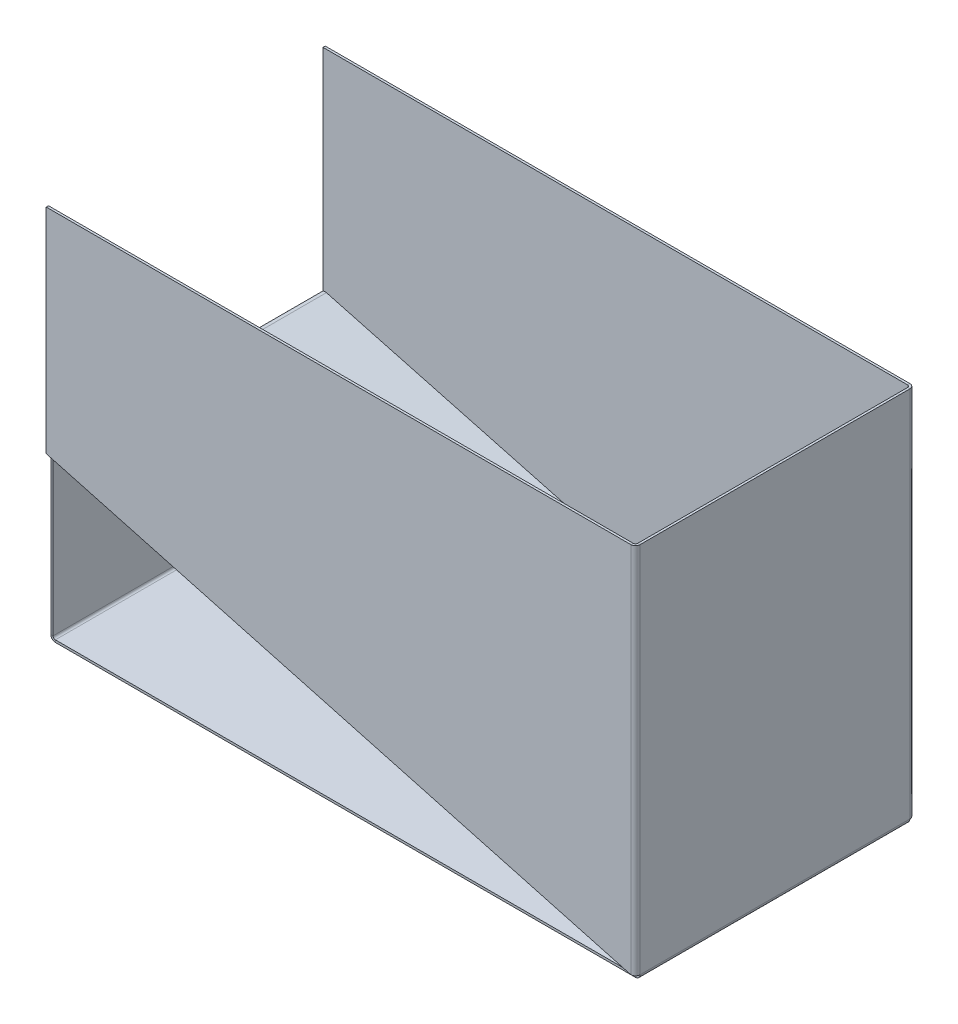
ISO-10303-21;
HEADER;
FILE_DESCRIPTION(('STEP AP214'),'2;1');
FILE_NAME('part.step','',(''),(''),'','','');
FILE_SCHEMA(('AUTOMOTIVE_DESIGN { 1 0 10303 214 1 1 1 1 }'));
ENDSEC;
DATA;
#1=APPLICATION_CONTEXT('core data for automotive mechanical design processes');
#2=APPLICATION_PROTOCOL_DEFINITION('international standard','automotive_design',2000,#1);
#3=PRODUCT_CONTEXT('',#1,'mechanical');
#4=PRODUCT('Part','Part','',(#3));
#5=PRODUCT_RELATED_PRODUCT_CATEGORY('part','',(#4));
#6=PRODUCT_DEFINITION_FORMATION('','',#4);
#7=PRODUCT_DEFINITION_CONTEXT('part definition',#1,'design');
#8=PRODUCT_DEFINITION('design','',#6,#7);
#9=PRODUCT_DEFINITION_SHAPE('','',#8);
#10=(LENGTH_UNIT() NAMED_UNIT(*) SI_UNIT(.MILLI.,.METRE.));
#11=(NAMED_UNIT(*) PLANE_ANGLE_UNIT() SI_UNIT($,.RADIAN.));
#12=(NAMED_UNIT(*) SI_UNIT($,.STERADIAN.) SOLID_ANGLE_UNIT());
#13=UNCERTAINTY_MEASURE_WITH_UNIT(LENGTH_MEASURE(1.E-05),#10,'distance_accuracy_value','');
#14=(GEOMETRIC_REPRESENTATION_CONTEXT(3) GLOBAL_UNCERTAINTY_ASSIGNED_CONTEXT((#13)) GLOBAL_UNIT_ASSIGNED_CONTEXT((#10,
#11,#12)) REPRESENTATION_CONTEXT('',''));
#15=CARTESIAN_POINT('',(0.,0.,0.));
#16=DIRECTION('',(0.,0.,1.));
#17=DIRECTION('',(1.,0.,0.));
#18=AXIS2_PLACEMENT_3D('',#15,#16,#17);
#19=CARTESIAN_POINT('',(0.,0.,1.522));
#20=DIRECTION('',(0.,0.,-1.));
#21=DIRECTION('',(-1.,0.,0.));
#22=AXIS2_PLACEMENT_3D('',#19,#20,#21);
#23=PLANE('',#22);
#24=DIRECTION('',(-0.964991177337424,0.262282343402928,0.));
#25=VECTOR('',#24,1.);
#26=CARTESIAN_POINT('',(-195.76,53.7620000000006,1.52200000000068));
#27=LINE('',#26,#25);
#28=CARTESIAN_POINT('',(-0.761999999999991,0.761999999999999,1.522));
#29=VERTEX_POINT('',#28);
#30=CARTESIAN_POINT('',(-195.76,53.7620000000007,1.52200000000068));
#31=VERTEX_POINT('',#30);
#32=EDGE_CURVE('E105',#29,#31,#27,.T.);
#33=ORIENTED_EDGE('',*,*,#32,.F.);
#34=DIRECTION('',(0.,1.,0.));
#35=VECTOR('',#34,1.);
#36=CARTESIAN_POINT('',(-0.761999999999995,0.762000000000339,1.522));
#37=LINE('',#36,#35);
#38=CARTESIAN_POINT('',(-0.761999999999561,125.,1.522));
#39=VERTEX_POINT('',#38);
#40=EDGE_CURVE('E266',#39,#29,#37,.F.);
#41=ORIENTED_EDGE('',*,*,#40,.F.);
#42=DIRECTION('',(-1.,0.,0.));
#43=VECTOR('',#42,1.);
#44=CARTESIAN_POINT('',(4.28004602885801E-13,125.,1.522));
#45=LINE('',#44,#43);
#46=CARTESIAN_POINT('',(-195.76,125.000000000001,1.52200000000068));
#47=VERTEX_POINT('',#46);
#48=EDGE_CURVE('E479',#39,#47,#45,.T.);
#49=ORIENTED_EDGE('',*,*,#48,.T.);
#50=DIRECTION('',(0.,-1.,0.));
#51=VECTOR('',#50,1.);
#52=CARTESIAN_POINT('',(-195.76,6.99744874517044E-13,1.52200000000068));
#53=LINE('',#52,#51);
#54=EDGE_CURVE('E269',#47,#31,#53,.T.);
#55=ORIENTED_EDGE('',*,*,#54,.T.);
#56=EDGE_LOOP('',(#33,#41,#49,#55));
#57=FACE_BOUND('',#56,.T.);
#58=ADVANCED_FACE('F88',(#57),#23,.F.);
#59=CARTESIAN_POINT('',(0.,0.,0.761999999999997));
#60=DIRECTION('',(0.,0.,-1.));
#61=DIRECTION('',(-1.,0.,0.));
#62=AXIS2_PLACEMENT_3D('',#59,#60,#61);
#63=PLANE('',#62);
#64=DIRECTION('',(0.,1.,0.));
#65=VECTOR('',#64,1.);
#66=CARTESIAN_POINT('',(-0.761999999999995,0.762000000000339,0.762));
#67=LINE('',#66,#65);
#68=CARTESIAN_POINT('',(-0.761999999999993,0.761999999999999,0.762000000000332));
#69=VERTEX_POINT('',#68);
#70=CARTESIAN_POINT('',(-0.761999999999554,125.,0.761999999999991));
#71=VERTEX_POINT('',#70);
#72=EDGE_CURVE('E259',#69,#71,#67,.T.);
#73=ORIENTED_EDGE('',*,*,#72,.F.);
#74=DIRECTION('',(-0.964991177337424,0.262282343402928,0.));
#75=VECTOR('',#74,1.);
#76=CARTESIAN_POINT('',(-195.76,53.7620000000006,0.762000000000679));
#77=LINE('',#76,#75);
#78=CARTESIAN_POINT('',(-195.76,53.7620000000007,0.762000000000681));
#79=VERTEX_POINT('',#78);
#80=EDGE_CURVE('E254',#69,#79,#77,.T.);
#81=ORIENTED_EDGE('',*,*,#80,.T.);
#82=DIRECTION('',(0.,1.,0.));
#83=VECTOR('',#82,1.);
#84=CARTESIAN_POINT('',(-195.76,0.762000000000681,0.762000000000681));
#85=LINE('',#84,#83);
#86=CARTESIAN_POINT('',(-195.76,125.000000000001,0.762000000000681));
#87=VERTEX_POINT('',#86);
#88=EDGE_CURVE('E476',#87,#79,#85,.F.);
#89=ORIENTED_EDGE('',*,*,#88,.F.);
#90=DIRECTION('',(1.,0.,0.));
#91=VECTOR('',#90,1.);
#92=CARTESIAN_POINT('',(-195.76,125.000000000001,0.762000000000681));
#93=LINE('',#92,#91);
#94=EDGE_CURVE('E279',#71,#87,#93,.F.);
#95=ORIENTED_EDGE('',*,*,#94,.F.);
#96=EDGE_LOOP('',(#73,#81,#89,#95));
#97=FACE_BOUND('',#96,.T.);
#98=ADVANCED_FACE('F529',(#97),#63,.T.);
#99=CARTESIAN_POINT('',(-195.76,0.762000000000681,1.52200000000068));
#100=DIRECTION('',(1.,0.,0.));
#101=DIRECTION('',(0.,1.,0.));
#102=AXIS2_PLACEMENT_3D('',#99,#100,#101);
#103=PLANE('',#102);
#104=DIRECTION('',(0.,0.,-1.));
#105=VECTOR('',#104,1.);
#106=CARTESIAN_POINT('',(-195.76,53.7620000000007,0.762000000000681));
#107=LINE('',#106,#105);
#108=EDGE_CURVE('E270',#79,#31,#107,.F.);
#109=ORIENTED_EDGE('',*,*,#108,.T.);
#110=ORIENTED_EDGE('',*,*,#54,.F.);
#111=DIRECTION('',(0.,0.,-1.));
#112=VECTOR('',#111,1.);
#113=CARTESIAN_POINT('',(-195.76,125.000000000001,1.52200000000068));
#114=LINE('',#113,#112);
#115=EDGE_CURVE('E297',#47,#87,#114,.T.);
#116=ORIENTED_EDGE('',*,*,#115,.T.);
#117=ORIENTED_EDGE('',*,*,#88,.T.);
#118=EDGE_LOOP('',(#109,#110,#116,#117));
#119=FACE_BOUND('',#118,.T.);
#120=ADVANCED_FACE('F531',(#119),#103,.F.);
#121=CARTESIAN_POINT('',(0.,-0.76,0.));
#122=DIRECTION('',(0.,1.,0.));
#123=DIRECTION('',(0.,0.,1.));
#124=AXIS2_PLACEMENT_3D('',#121,#122,#123);
#125=PLANE('',#124);
#126=DIRECTION('',(0.,0.,-1.));
#127=VECTOR('',#126,1.);
#128=CARTESIAN_POINT('',(-0.762,-0.760000000000003,-90.));
#129=LINE('',#128,#127);
#130=CARTESIAN_POINT('',(-0.762,-0.760000000000003,-90.));
#131=VERTEX_POINT('',#130);
#132=CARTESIAN_POINT('',(-0.762000000000004,-0.76,0.));
#133=VERTEX_POINT('',#132);
#134=EDGE_CURVE('E327',#131,#133,#129,.F.);
#135=ORIENTED_EDGE('',*,*,#134,.T.);
#136=DIRECTION('',(1.,0.,0.));
#137=VECTOR('',#136,1.);
#138=CARTESIAN_POINT('',(0.,-0.76,0.));
#139=LINE('',#138,#137);
#140=CARTESIAN_POINT('',(-194.238,-0.759999999999997,0.));
#141=VERTEX_POINT('',#140);
#142=EDGE_CURVE('E15',#141,#133,#139,.T.);
#143=ORIENTED_EDGE('',*,*,#142,.F.);
#144=DIRECTION('',(0.,0.,1.));
#145=VECTOR('',#144,1.);
#146=CARTESIAN_POINT('',(-194.238,-0.759999999999997,0.));
#147=LINE('',#146,#145);
#148=CARTESIAN_POINT('',(-194.238,-0.76,-89.9999999999999));
#149=VERTEX_POINT('',#148);
#150=EDGE_CURVE('E420',#141,#149,#147,.F.);
#151=ORIENTED_EDGE('',*,*,#150,.T.);
#152=DIRECTION('',(-1.,0.,0.));
#153=VECTOR('',#152,1.);
#154=CARTESIAN_POINT('',(0.,-0.76,-90.));
#155=LINE('',#154,#153);
#156=EDGE_CURVE('E97',#131,#149,#155,.T.);
#157=ORIENTED_EDGE('',*,*,#156,.F.);
#158=EDGE_LOOP('',(#135,#143,#151,#157));
#159=FACE_BOUND('',#158,.T.);
#160=ADVANCED_FACE('F557',(#159),#125,.F.);
#161=CARTESIAN_POINT('',(0.,0.,0.));
#162=DIRECTION('',(0.,1.,0.));
#163=DIRECTION('',(0.,0.,1.));
#164=AXIS2_PLACEMENT_3D('',#161,#162,#163);
#165=PLANE('',#164);
#166=DIRECTION('',(1.,0.,0.));
#167=VECTOR('',#166,1.);
#168=CARTESIAN_POINT('',(0.,0.,0.));
#169=LINE('',#168,#167);
#170=CARTESIAN_POINT('',(-194.238,0.,0.));
#171=VERTEX_POINT('',#170);
#172=CARTESIAN_POINT('',(-0.762000000000004,0.,0.));
#173=VERTEX_POINT('',#172);
#174=EDGE_CURVE('E92',#171,#173,#169,.T.);
#175=ORIENTED_EDGE('',*,*,#174,.T.);
#176=DIRECTION('',(0.,0.,-1.));
#177=VECTOR('',#176,1.);
#178=CARTESIAN_POINT('',(-0.761999999999997,0.,-90.));
#179=LINE('',#178,#177);
#180=CARTESIAN_POINT('',(-0.761999999999997,0.,-90.));
#181=VERTEX_POINT('',#180);
#182=EDGE_CURVE('E339',#181,#173,#179,.F.);
#183=ORIENTED_EDGE('',*,*,#182,.F.);
#184=DIRECTION('',(-1.,0.,0.));
#185=VECTOR('',#184,1.);
#186=CARTESIAN_POINT('',(0.,0.,-90.));
#187=LINE('',#186,#185);
#188=CARTESIAN_POINT('',(-194.238,0.,-89.9999999999999));
#189=VERTEX_POINT('',#188);
#190=EDGE_CURVE('E441',#181,#189,#187,.T.);
#191=ORIENTED_EDGE('',*,*,#190,.T.);
#192=DIRECTION('',(0.,0.,1.));
#193=VECTOR('',#192,1.);
#194=CARTESIAN_POINT('',(-194.238,0.,0.));
#195=LINE('',#194,#193);
#196=EDGE_CURVE('E433',#171,#189,#195,.F.);
#197=ORIENTED_EDGE('',*,*,#196,.F.);
#198=EDGE_LOOP('',(#175,#183,#191,#197));
#199=FACE_BOUND('',#198,.T.);
#200=ADVANCED_FACE('F449',(#199),#165,.T.);
#201=CARTESIAN_POINT('',(0.,-0.76,-90.));
#202=DIRECTION('',(0.,0.,-1.));
#203=DIRECTION('',(-1.,0.,0.));
#204=AXIS2_PLACEMENT_3D('',#201,#202,#203);
#205=PLANE('',#204);
#206=ORIENTED_EDGE('',*,*,#190,.F.);
#207=DIRECTION('',(0.,-1.,0.));
#208=VECTOR('',#207,1.);
#209=CARTESIAN_POINT('',(-0.761999999999997,0.,-90.));
#210=LINE('',#209,#208);
#211=EDGE_CURVE('E333',#181,#131,#210,.T.);
#212=ORIENTED_EDGE('',*,*,#211,.T.);
#213=ORIENTED_EDGE('',*,*,#156,.T.);
#214=DIRECTION('',(0.,-1.,0.));
#215=VECTOR('',#214,1.);
#216=CARTESIAN_POINT('',(-194.238,0.,-89.9999999999999));
#217=LINE('',#216,#215);
#218=EDGE_CURVE('E438',#189,#149,#217,.T.);
#219=ORIENTED_EDGE('',*,*,#218,.F.);
#220=EDGE_LOOP('',(#206,#212,#213,#219));
#221=FACE_BOUND('',#220,.T.);
#222=ADVANCED_FACE('F90',(#221),#205,.T.);
#223=CARTESIAN_POINT('',(-195.76,0.,-89.9999999999999));
#224=DIRECTION('',(0.,0.,1.));
#225=DIRECTION('',(1.,0.,0.));
#226=AXIS2_PLACEMENT_3D('',#223,#224,#225);
#227=PLANE('',#226);
#228=DIRECTION('',(-1.,0.,0.));
#229=VECTOR('',#228,1.);
#230=CARTESIAN_POINT('',(-195.,54.006942265895,-89.9999999999999));
#231=LINE('',#230,#229);
#232=CARTESIAN_POINT('',(-195.,54.006942265895,-89.9999999999999));
#233=VERTEX_POINT('',#232);
#234=CARTESIAN_POINT('',(-195.76,54.006942265895,-89.9999999999999));
#235=VERTEX_POINT('',#234);
#236=EDGE_CURVE('E395',#233,#235,#231,.T.);
#237=ORIENTED_EDGE('',*,*,#236,.F.);
#238=DIRECTION('',(0.,-1.,0.));
#239=VECTOR('',#238,1.);
#240=CARTESIAN_POINT('',(-195.,0.,-89.9999999999999));
#241=LINE('',#240,#239);
#242=CARTESIAN_POINT('',(-195.,0.761999999999985,-89.9999999999999));
#243=VERTEX_POINT('',#242);
#244=EDGE_CURVE('E411',#233,#243,#241,.T.);
#245=ORIENTED_EDGE('',*,*,#244,.T.);
#246=DIRECTION('',(-1.,0.,0.));
#247=VECTOR('',#246,1.);
#248=CARTESIAN_POINT('',(-195.,0.761999999999985,-89.9999999999999));
#249=LINE('',#248,#247);
#250=CARTESIAN_POINT('',(-195.76,0.761999999999982,-89.9999999999999));
#251=VERTEX_POINT('',#250);
#252=EDGE_CURVE('E398',#243,#251,#249,.T.);
#253=ORIENTED_EDGE('',*,*,#252,.T.);
#254=DIRECTION('',(0.,-1.,0.));
#255=VECTOR('',#254,1.);
#256=CARTESIAN_POINT('',(-195.76,0.,-89.9999999999999));
#257=LINE('',#256,#255);
#258=EDGE_CURVE('E412',#235,#251,#257,.T.);
#259=ORIENTED_EDGE('',*,*,#258,.F.);
#260=EDGE_LOOP('',(#237,#245,#253,#259));
#261=FACE_BOUND('',#260,.T.);
#262=ADVANCED_FACE('F975',(#261),#227,.F.);
#263=CARTESIAN_POINT('',(-195.76,55.,0.));
#264=DIRECTION('',(0.,0.,-1.));
#265=DIRECTION('',(0.,1.,0.));
#266=AXIS2_PLACEMENT_3D('',#263,#264,#265);
#267=PLANE('',#266);
#268=DIRECTION('',(-1.,0.,0.));
#269=VECTOR('',#268,1.);
#270=CARTESIAN_POINT('',(-195.,54.006942265895,0.));
#271=LINE('',#270,#269);
#272=CARTESIAN_POINT('',(-195.,54.006942265895,0.));
#273=VERTEX_POINT('',#272);
#274=CARTESIAN_POINT('',(-195.76,54.006942265895,0.));
#275=VERTEX_POINT('',#274);
#276=EDGE_CURVE('E386',#273,#275,#271,.T.);
#277=ORIENTED_EDGE('',*,*,#276,.T.);
#278=DIRECTION('',(0.,1.,0.));
#279=VECTOR('',#278,1.);
#280=CARTESIAN_POINT('',(-195.76,55.,0.));
#281=LINE('',#280,#279);
#282=CARTESIAN_POINT('',(-195.76,0.761999999999982,0.));
#283=VERTEX_POINT('',#282);
#284=EDGE_CURVE('E414',#283,#275,#281,.T.);
#285=ORIENTED_EDGE('',*,*,#284,.F.);
#286=DIRECTION('',(-1.,0.,0.));
#287=VECTOR('',#286,1.);
#288=CARTESIAN_POINT('',(-195.,0.761999999999985,0.));
#289=LINE('',#288,#287);
#290=CARTESIAN_POINT('',(-195.,0.761999999999985,0.));
#291=VERTEX_POINT('',#290);
#292=EDGE_CURVE('E403',#291,#283,#289,.T.);
#293=ORIENTED_EDGE('',*,*,#292,.F.);
#294=DIRECTION('',(0.,1.,0.));
#295=VECTOR('',#294,1.);
#296=CARTESIAN_POINT('',(-195.,55.,0.));
#297=LINE('',#296,#295);
#298=EDGE_CURVE('E415',#291,#273,#297,.T.);
#299=ORIENTED_EDGE('',*,*,#298,.T.);
#300=EDGE_LOOP('',(#277,#285,#293,#299));
#301=FACE_BOUND('',#300,.T.);
#302=ADVANCED_FACE('F965',(#301),#267,.F.);
#303=CARTESIAN_POINT('',(-195.76,-6.91496447914493E-13,0.));
#304=DIRECTION('',(1.,0.,0.));
#305=DIRECTION('',(0.,1.,0.));
#306=AXIS2_PLACEMENT_3D('',#303,#304,#305);
#307=PLANE('',#306);
#308=DIRECTION('',(0.,0.,1.));
#309=VECTOR('',#308,1.);
#310=CARTESIAN_POINT('',(-195.76,54.006942265895,0.));
#311=LINE('',#310,#309);
#312=EDGE_CURVE('E380',#275,#235,#311,.F.);
#313=ORIENTED_EDGE('',*,*,#312,.T.);
#314=ORIENTED_EDGE('',*,*,#258,.T.);
#315=DIRECTION('',(0.,0.,-1.));
#316=VECTOR('',#315,1.);
#317=CARTESIAN_POINT('',(-195.76,0.761999999999982,0.));
#318=LINE('',#317,#316);
#319=EDGE_CURVE('E406',#283,#251,#318,.T.);
#320=ORIENTED_EDGE('',*,*,#319,.F.);
#321=ORIENTED_EDGE('',*,*,#284,.T.);
#322=EDGE_LOOP('',(#313,#314,#320,#321));
#323=FACE_BOUND('',#322,.T.);
#324=ADVANCED_FACE('F579',(#323),#307,.F.);
#325=CARTESIAN_POINT('',(-195.,-6.88842922096972E-13,0.));
#326=DIRECTION('',(1.,0.,0.));
#327=DIRECTION('',(0.,1.,0.));
#328=AXIS2_PLACEMENT_3D('',#325,#326,#327);
#329=PLANE('',#328);
#330=ORIENTED_EDGE('',*,*,#244,.F.);
#331=DIRECTION('',(0.,0.,1.));
#332=VECTOR('',#331,1.);
#333=CARTESIAN_POINT('',(-195.,54.006942265895,0.));
#334=LINE('',#333,#332);
#335=EDGE_CURVE('E113',#273,#233,#334,.F.);
#336=ORIENTED_EDGE('',*,*,#335,.F.);
#337=ORIENTED_EDGE('',*,*,#298,.F.);
#338=DIRECTION('',(0.,0.,1.));
#339=VECTOR('',#338,1.);
#340=CARTESIAN_POINT('',(-195.,0.761999999999985,-89.9999999999999));
#341=LINE('',#340,#339);
#342=EDGE_CURVE('E401',#243,#291,#341,.T.);
#343=ORIENTED_EDGE('',*,*,#342,.F.);
#344=EDGE_LOOP('',(#330,#336,#337,#343));
#345=FACE_BOUND('',#344,.T.);
#346=ADVANCED_FACE('F573',(#345),#329,.T.);
#347=CARTESIAN_POINT('',(0.,-0.76,0.));
#348=DIRECTION('',(0.,0.,1.));
#349=DIRECTION('',(1.,0.,0.));
#350=AXIS2_PLACEMENT_3D('',#347,#348,#349);
#351=PLANE('',#350);
#352=DIRECTION('',(0.,-1.,0.));
#353=VECTOR('',#352,1.);
#354=CARTESIAN_POINT('',(-0.762000000000004,0.,0.));
#355=LINE('',#354,#353);
#356=EDGE_CURVE('E344',#173,#133,#355,.T.);
#357=ORIENTED_EDGE('',*,*,#356,.F.);
#358=ORIENTED_EDGE('',*,*,#174,.F.);
#359=DIRECTION('',(0.,-1.,0.));
#360=VECTOR('',#359,1.);
#361=CARTESIAN_POINT('',(-194.238,0.,0.));
#362=LINE('',#361,#360);
#363=EDGE_CURVE('E427',#171,#141,#362,.T.);
#364=ORIENTED_EDGE('',*,*,#363,.T.);
#365=ORIENTED_EDGE('',*,*,#142,.T.);
#366=EDGE_LOOP('',(#357,#358,#364,#365));
#367=FACE_BOUND('',#366,.T.);
#368=ADVANCED_FACE('F570',(#367),#351,.T.);
#369=CARTESIAN_POINT('',(-194.238,0.761999999999988,-89.9999999999999));
#370=DIRECTION('',(0.,0.,-1.));
#371=DIRECTION('',(-1.,0.,0.));
#372=AXIS2_PLACEMENT_3D('',#369,#370,#371);
#373=PLANE('',#372);
#374=ORIENTED_EDGE('',*,*,#252,.F.);
#375=CARTESIAN_POINT('',(-194.238,0.761999999999988,-89.9999999999999));
#376=DIRECTION('',(0.,0.,1.));
#377=DIRECTION('',(1.,0.,0.));
#378=AXIS2_PLACEMENT_3D('',#375,#376,#377);
#379=CIRCLE('',#378,0.761999999999985);
#380=EDGE_CURVE('E430',#189,#243,#379,.F.);
#381=ORIENTED_EDGE('',*,*,#380,.F.);
#382=ORIENTED_EDGE('',*,*,#218,.T.);
#383=CARTESIAN_POINT('',(-194.238,0.761999999999988,-89.9999999999999));
#384=DIRECTION('',(0.,0.,1.));
#385=DIRECTION('',(1.,0.,0.));
#386=AXIS2_PLACEMENT_3D('',#383,#384,#385);
#387=CIRCLE('',#386,1.52199999999998);
#388=EDGE_CURVE('E423',#149,#251,#387,.F.);
#389=ORIENTED_EDGE('',*,*,#388,.T.);
#390=EDGE_LOOP('',(#374,#381,#382,#389));
#391=FACE_BOUND('',#390,.T.);
#392=ADVANCED_FACE('F572',(#391),#373,.T.);
#393=CARTESIAN_POINT('',(-194.238,0.761999999999988,0.));
#394=DIRECTION('',(0.,0.,-1.));
#395=DIRECTION('',(-1.,0.,0.));
#396=AXIS2_PLACEMENT_3D('',#393,#394,#395);
#397=PLANE('',#396);
#398=CARTESIAN_POINT('',(-194.238,0.761999999999988,0.));
#399=DIRECTION('',(0.,0.,1.));
#400=DIRECTION('',(1.,0.,0.));
#401=AXIS2_PLACEMENT_3D('',#398,#399,#400);
#402=CIRCLE('',#401,0.761999999999985);
#403=EDGE_CURVE('E417',#291,#171,#402,.T.);
#404=ORIENTED_EDGE('',*,*,#403,.F.);
#405=ORIENTED_EDGE('',*,*,#292,.T.);
#406=CARTESIAN_POINT('',(-194.238,0.761999999999988,0.));
#407=DIRECTION('',(0.,0.,1.));
#408=DIRECTION('',(1.,0.,0.));
#409=AXIS2_PLACEMENT_3D('',#406,#407,#408);
#410=CIRCLE('',#409,1.52199999999998);
#411=EDGE_CURVE('E424',#283,#141,#410,.T.);
#412=ORIENTED_EDGE('',*,*,#411,.T.);
#413=ORIENTED_EDGE('',*,*,#363,.F.);
#414=EDGE_LOOP('',(#404,#405,#412,#413));
#415=FACE_BOUND('',#414,.T.);
#416=ADVANCED_FACE('F568',(#415),#397,.F.);
#417=CARTESIAN_POINT('',(-194.238,0.761999999999988,0.));
#418=DIRECTION('',(0.,0.,1.));
#419=DIRECTION('',(-1.,0.,0.));
#420=AXIS2_PLACEMENT_3D('',#417,#418,#419);
#421=CYLINDRICAL_SURFACE('',#420,1.52199999999998);
#422=ORIENTED_EDGE('',*,*,#150,.F.);
#423=ORIENTED_EDGE('',*,*,#411,.F.);
#424=ORIENTED_EDGE('',*,*,#319,.T.);
#425=ORIENTED_EDGE('',*,*,#388,.F.);
#426=EDGE_LOOP('',(#422,#423,#424,#425));
#427=FACE_BOUND('',#426,.T.);
#428=ADVANCED_FACE('F912',(#427),#421,.T.);
#429=CARTESIAN_POINT('',(-194.238,0.761999999999988,0.));
#430=DIRECTION('',(0.,0.,1.));
#431=DIRECTION('',(-1.,0.,0.));
#432=AXIS2_PLACEMENT_3D('',#429,#430,#431);
#433=CYLINDRICAL_SURFACE('',#432,0.761999999999985);
#434=ORIENTED_EDGE('',*,*,#196,.T.);
#435=ORIENTED_EDGE('',*,*,#380,.T.);
#436=ORIENTED_EDGE('',*,*,#342,.T.);
#437=ORIENTED_EDGE('',*,*,#403,.T.);
#438=EDGE_LOOP('',(#434,#435,#436,#437));
#439=FACE_BOUND('',#438,.T.);
#440=ADVANCED_FACE('F903',(#439),#433,.F.);
#441=CARTESIAN_POINT('',(-194.238,54.006942265895,-89.9999999999999));
#442=DIRECTION('',(0.,0.,-1.));
#443=DIRECTION('',(-1.,0.,0.));
#444=AXIS2_PLACEMENT_3D('',#441,#442,#443);
#445=PLANE('',#444);
#446=DIRECTION('',(0.258819045102515,0.96592582628907,0.));
#447=VECTOR('',#446,1.);
#448=CARTESIAN_POINT('',(-194.040779887632,54.7429777455273,-89.9999999999999));
#449=LINE('',#448,#447);
#450=CARTESIAN_POINT('',(-194.040779887632,54.7429777455273,-89.9999999999999));
#451=VERTEX_POINT('',#450);
#452=CARTESIAN_POINT('',(-193.844077413354,55.477081373507,-89.9999999999999));
#453=VERTEX_POINT('',#452);
#454=EDGE_CURVE('E347',#451,#453,#449,.T.);
#455=ORIENTED_EDGE('',*,*,#454,.F.);
#456=CARTESIAN_POINT('',(-194.238,54.006942265895,-89.9999999999999));
#457=DIRECTION('',(0.,0.,1.));
#458=DIRECTION('',(1.,0.,0.));
#459=AXIS2_PLACEMENT_3D('',#456,#457,#458);
#460=CIRCLE('',#459,0.762000000000002);
#461=EDGE_CURVE('E389',#233,#451,#460,.F.);
#462=ORIENTED_EDGE('',*,*,#461,.F.);
#463=ORIENTED_EDGE('',*,*,#236,.T.);
#464=CARTESIAN_POINT('',(-194.238,54.006942265895,-89.9999999999999));
#465=DIRECTION('',(0.,0.,1.));
#466=DIRECTION('',(1.,0.,0.));
#467=AXIS2_PLACEMENT_3D('',#464,#465,#466);
#468=CIRCLE('',#467,1.522);
#469=EDGE_CURVE('E382',#235,#453,#468,.F.);
#470=ORIENTED_EDGE('',*,*,#469,.T.);
#471=EDGE_LOOP('',(#455,#462,#463,#470));
#472=FACE_BOUND('',#471,.T.);
#473=ADVANCED_FACE('F895',(#472),#445,.T.);
#474=CARTESIAN_POINT('',(-194.238,54.006942265895,0.));
#475=DIRECTION('',(0.,0.,-1.));
#476=DIRECTION('',(-1.,0.,0.));
#477=AXIS2_PLACEMENT_3D('',#474,#475,#476);
#478=PLANE('',#477);
#479=CARTESIAN_POINT('',(-194.238,54.006942265895,0.));
#480=DIRECTION('',(0.,0.,1.));
#481=DIRECTION('',(1.,0.,0.));
#482=AXIS2_PLACEMENT_3D('',#479,#480,#481);
#483=CIRCLE('',#482,0.762000000000002);
#484=CARTESIAN_POINT('',(-194.040779887632,54.7429777455273,0.));
#485=VERTEX_POINT('',#484);
#486=EDGE_CURVE('E379',#485,#273,#483,.T.);
#487=ORIENTED_EDGE('',*,*,#486,.F.);
#488=DIRECTION('',(0.258819045102515,0.96592582628907,0.));
#489=VECTOR('',#488,1.);
#490=CARTESIAN_POINT('',(-194.040779887632,54.7429777455273,0.));
#491=LINE('',#490,#489);
#492=CARTESIAN_POINT('',(-193.844077413354,55.477081373507,0.));
#493=VERTEX_POINT('',#492);
#494=EDGE_CURVE('E352',#485,#493,#491,.T.);
#495=ORIENTED_EDGE('',*,*,#494,.T.);
#496=CARTESIAN_POINT('',(-194.238,54.006942265895,0.));
#497=DIRECTION('',(0.,0.,1.));
#498=DIRECTION('',(1.,0.,0.));
#499=AXIS2_PLACEMENT_3D('',#496,#497,#498);
#500=CIRCLE('',#499,1.522);
#501=EDGE_CURVE('E383',#493,#275,#500,.T.);
#502=ORIENTED_EDGE('',*,*,#501,.T.);
#503=ORIENTED_EDGE('',*,*,#276,.F.);
#504=EDGE_LOOP('',(#487,#495,#502,#503));
#505=FACE_BOUND('',#504,.T.);
#506=ADVANCED_FACE('F887',(#505),#478,.F.);
#507=CARTESIAN_POINT('',(-194.238,54.006942265895,0.));
#508=DIRECTION('',(0.,0.,1.));
#509=DIRECTION('',(0.258819045102515,0.96592582628907,0.));
#510=AXIS2_PLACEMENT_3D('',#507,#508,#509);
#511=CYLINDRICAL_SURFACE('',#510,1.522);
#512=ORIENTED_EDGE('',*,*,#312,.F.);
#513=ORIENTED_EDGE('',*,*,#501,.F.);
#514=DIRECTION('',(0.,0.,-1.));
#515=VECTOR('',#514,1.);
#516=CARTESIAN_POINT('',(-193.844077413354,55.477081373507,0.));
#517=LINE('',#516,#515);
#518=EDGE_CURVE('E355',#493,#453,#517,.T.);
#519=ORIENTED_EDGE('',*,*,#518,.T.);
#520=ORIENTED_EDGE('',*,*,#469,.F.);
#521=EDGE_LOOP('',(#512,#513,#519,#520));
#522=FACE_BOUND('',#521,.T.);
#523=ADVANCED_FACE('F879',(#522),#511,.T.);
#524=CARTESIAN_POINT('',(-194.238,54.006942265895,0.));
#525=DIRECTION('',(0.,0.,1.));
#526=DIRECTION('',(0.258819045102515,0.96592582628907,0.));
#527=AXIS2_PLACEMENT_3D('',#524,#525,#526);
#528=CYLINDRICAL_SURFACE('',#527,0.762000000000002);
#529=ORIENTED_EDGE('',*,*,#335,.T.);
#530=ORIENTED_EDGE('',*,*,#461,.T.);
#531=DIRECTION('',(0.,0.,1.));
#532=VECTOR('',#531,1.);
#533=CARTESIAN_POINT('',(-194.040779887632,54.7429777455273,-89.9999999999999));
#534=LINE('',#533,#532);
#535=EDGE_CURVE('E350',#451,#485,#534,.T.);
#536=ORIENTED_EDGE('',*,*,#535,.T.);
#537=ORIENTED_EDGE('',*,*,#486,.T.);
#538=EDGE_LOOP('',(#529,#530,#536,#537));
#539=FACE_BOUND('',#538,.T.);
#540=ADVANCED_FACE('F871',(#539),#528,.F.);
#541=CARTESIAN_POINT('',(-1.61813226790831,3.97029460747678,0.));
#542=DIRECTION('',(0.,0.,-1.));
#543=DIRECTION('',(-1.,0.,0.));
#544=AXIS2_PLACEMENT_3D('',#541,#542,#543);
#545=PLANE('',#544);
#546=ORIENTED_EDGE('',*,*,#494,.F.);
#547=DIRECTION('',(0.96592582628907,-0.258819045102515,0.));
#548=VECTOR('',#547,1.);
#549=CARTESIAN_POINT('',(-1.81483474218622,3.23619097949709,0.));
#550=LINE('',#549,#548);
#551=CARTESIAN_POINT('',(-1.81483474218622,3.23619097949709,0.));
#552=VERTEX_POINT('',#551);
#553=EDGE_CURVE('E359',#485,#552,#550,.T.);
#554=ORIENTED_EDGE('',*,*,#553,.T.);
#555=DIRECTION('',(-0.258819045102515,-0.96592582628907,0.));
#556=VECTOR('',#555,1.);
#557=CARTESIAN_POINT('',(-1.61813226790831,3.97029460747678,0.));
#558=LINE('',#557,#556);
#559=CARTESIAN_POINT('',(-1.61813226790831,3.97029460747678,0.));
#560=VERTEX_POINT('',#559);
#561=EDGE_CURVE('E376',#560,#552,#558,.T.);
#562=ORIENTED_EDGE('',*,*,#561,.F.);
#563=DIRECTION('',(0.96592582628907,-0.258819045102515,0.));
#564=VECTOR('',#563,1.);
#565=CARTESIAN_POINT('',(-1.61813226790831,3.97029460747678,0.));
#566=LINE('',#565,#564);
#567=EDGE_CURVE('E360',#493,#560,#566,.T.);
#568=ORIENTED_EDGE('',*,*,#567,.F.);
#569=EDGE_LOOP('',(#546,#554,#562,#568));
#570=FACE_BOUND('',#569,.T.);
#571=ADVANCED_FACE('F863',(#570),#545,.F.);
#572=CARTESIAN_POINT('',(-194.803297525722,55.7341036279797,-89.9999999999999));
#573=DIRECTION('',(0.,0.,1.));
#574=DIRECTION('',(1.,0.,0.));
#575=AXIS2_PLACEMENT_3D('',#572,#573,#574);
#576=PLANE('',#575);
#577=ORIENTED_EDGE('',*,*,#454,.T.);
#578=DIRECTION('',(-0.96592582628907,0.258819045102515,0.));
#579=VECTOR('',#578,1.);
#580=CARTESIAN_POINT('',(-194.803297525722,55.7341036279797,-89.9999999999999));
#581=LINE('',#580,#579);
#582=CARTESIAN_POINT('',(-1.61813226790831,3.97029460747678,-89.9999999999999));
#583=VERTEX_POINT('',#582);
#584=EDGE_CURVE('E365',#583,#453,#581,.T.);
#585=ORIENTED_EDGE('',*,*,#584,.F.);
#586=DIRECTION('',(-0.258819045102515,-0.96592582628907,0.));
#587=VECTOR('',#586,1.);
#588=CARTESIAN_POINT('',(-1.61813226790831,3.97029460747678,-89.9999999999999));
#589=LINE('',#588,#587);
#590=CARTESIAN_POINT('',(-1.81483474218622,3.23619097949709,-89.9999999999999));
#591=VERTEX_POINT('',#590);
#592=EDGE_CURVE('E368',#583,#591,#589,.T.);
#593=ORIENTED_EDGE('',*,*,#592,.T.);
#594=DIRECTION('',(-0.96592582628907,0.258819045102515,0.));
#595=VECTOR('',#594,1.);
#596=CARTESIAN_POINT('',(-195.,55.,-89.9999999999999));
#597=LINE('',#596,#595);
#598=EDGE_CURVE('E363',#591,#451,#597,.T.);
#599=ORIENTED_EDGE('',*,*,#598,.T.);
#600=EDGE_LOOP('',(#577,#585,#593,#599));
#601=FACE_BOUND('',#600,.T.);
#602=ADVANCED_FACE('F855',(#601),#576,.F.);
#603=CARTESIAN_POINT('',(0.884179343260987,3.29980223205297,0.));
#604=DIRECTION('',(-0.258819045102515,-0.96592582628907,0.));
#605=DIRECTION('',(0.96592582628907,-0.258819045102515,0.));
#606=AXIS2_PLACEMENT_3D('',#603,#604,#605);
#607=PLANE('',#606);
#608=ORIENTED_EDGE('',*,*,#518,.F.);
#609=ORIENTED_EDGE('',*,*,#567,.T.);
#610=DIRECTION('',(0.,0.,-1.));
#611=VECTOR('',#610,1.);
#612=CARTESIAN_POINT('',(-1.61813226790831,3.97029460747678,-89.9999999999999));
#613=LINE('',#612,#611);
#614=EDGE_CURVE('E362',#560,#583,#613,.T.);
#615=ORIENTED_EDGE('',*,*,#614,.T.);
#616=ORIENTED_EDGE('',*,*,#584,.T.);
#617=EDGE_LOOP('',(#608,#609,#615,#616));
#618=FACE_BOUND('',#617,.T.);
#619=ADVANCED_FACE('F847',(#618),#607,.F.);
#620=CARTESIAN_POINT('',(0.687476868983076,2.56569860407328,0.));
#621=DIRECTION('',(-0.258819045102515,-0.96592582628907,0.));
#622=DIRECTION('',(0.96592582628907,-0.258819045102515,0.));
#623=AXIS2_PLACEMENT_3D('',#620,#621,#622);
#624=PLANE('',#623);
#625=ORIENTED_EDGE('',*,*,#553,.F.);
#626=ORIENTED_EDGE('',*,*,#535,.F.);
#627=ORIENTED_EDGE('',*,*,#598,.F.);
#628=DIRECTION('',(0.,0.,-1.));
#629=VECTOR('',#628,1.);
#630=CARTESIAN_POINT('',(-1.81483474218622,3.23619097949709,-89.9999999999999));
#631=LINE('',#630,#629);
#632=EDGE_CURVE('E370',#552,#591,#631,.T.);
#633=ORIENTED_EDGE('',*,*,#632,.F.);
#634=EDGE_LOOP('',(#625,#626,#627,#633));
#635=FACE_BOUND('',#634,.T.);
#636=ADVANCED_FACE('F839',(#635),#624,.T.);
#637=CARTESIAN_POINT('',(-1.61813226790831,3.97029460747678,-89.9999999999999));
#638=DIRECTION('',(-0.96592582628907,0.258819045102515,0.));
#639=DIRECTION('',(-0.258819045102515,-0.96592582628907,0.));
#640=AXIS2_PLACEMENT_3D('',#637,#638,#639);
#641=PLANE('',#640);
#642=ORIENTED_EDGE('',*,*,#632,.T.);
#643=ORIENTED_EDGE('',*,*,#592,.F.);
#644=ORIENTED_EDGE('',*,*,#614,.F.);
#645=ORIENTED_EDGE('',*,*,#561,.T.);
#646=EDGE_LOOP('',(#642,#643,#644,#645));
#647=FACE_BOUND('',#646,.T.);
#648=ADVANCED_FACE('F833',(#647),#641,.F.);
#649=CARTESIAN_POINT('',(-0.762000000000001,0.762,0.));
#650=DIRECTION('',(0.,0.,1.));
#651=DIRECTION('',(1.,0.,0.));
#652=AXIS2_PLACEMENT_3D('',#649,#650,#651);
#653=PLANE('',#652);
#654=DIRECTION('',(1.,0.,0.));
#655=VECTOR('',#654,1.);
#656=CARTESIAN_POINT('',(0.,0.761999999999997,0.));
#657=LINE('',#656,#655);
#658=CARTESIAN_POINT('',(0.,0.761999999999999,0.));
#659=VERTEX_POINT('',#658);
#660=CARTESIAN_POINT('',(0.760000000000003,0.761999999999995,0.));
#661=VERTEX_POINT('',#660);
#662=EDGE_CURVE('E284',#659,#661,#657,.T.);
#663=ORIENTED_EDGE('',*,*,#662,.F.);
#664=CARTESIAN_POINT('',(-0.762000000000001,0.762,0.));
#665=DIRECTION('',(0.,0.,-1.));
#666=DIRECTION('',(-1.,0.,0.));
#667=AXIS2_PLACEMENT_3D('',#664,#665,#666);
#668=CIRCLE('',#667,0.762000000000003);
#669=EDGE_CURVE('E336',#173,#659,#668,.F.);
#670=ORIENTED_EDGE('',*,*,#669,.F.);
#671=ORIENTED_EDGE('',*,*,#356,.T.);
#672=CARTESIAN_POINT('',(-0.762000000000001,0.762,0.));
#673=DIRECTION('',(0.,0.,-1.));
#674=DIRECTION('',(-1.,0.,0.));
#675=AXIS2_PLACEMENT_3D('',#672,#673,#674);
#676=CIRCLE('',#675,1.522);
#677=EDGE_CURVE('E329',#133,#661,#676,.F.);
#678=ORIENTED_EDGE('',*,*,#677,.T.);
#679=EDGE_LOOP('',(#663,#670,#671,#678));
#680=FACE_BOUND('',#679,.T.);
#681=ADVANCED_FACE('F458',(#680),#653,.T.);
#682=CARTESIAN_POINT('',(-0.761999999999994,0.762,-90.));
#683=DIRECTION('',(0.,0.,1.));
#684=DIRECTION('',(1.,0.,0.));
#685=AXIS2_PLACEMENT_3D('',#682,#683,#684);
#686=PLANE('',#685);
#687=CARTESIAN_POINT('',(-0.761999999999994,0.762,-90.));
#688=DIRECTION('',(0.,0.,-1.));
#689=DIRECTION('',(-1.,0.,0.));
#690=AXIS2_PLACEMENT_3D('',#687,#688,#689);
#691=CIRCLE('',#690,0.762000000000003);
#692=CARTESIAN_POINT('',(0.,0.761999999999996,-90.));
#693=VERTEX_POINT('',#692);
#694=EDGE_CURVE('E326',#693,#181,#691,.T.);
#695=ORIENTED_EDGE('',*,*,#694,.F.);
#696=DIRECTION('',(1.,0.,0.));
#697=VECTOR('',#696,1.);
#698=CARTESIAN_POINT('',(0.,0.761999999999997,-90.));
#699=LINE('',#698,#697);
#700=CARTESIAN_POINT('',(0.759999999999989,0.761999999999994,-90.));
#701=VERTEX_POINT('',#700);
#702=EDGE_CURVE('E300',#693,#701,#699,.T.);
#703=ORIENTED_EDGE('',*,*,#702,.T.);
#704=CARTESIAN_POINT('',(-0.761999999999994,0.762,-90.));
#705=DIRECTION('',(0.,0.,-1.));
#706=DIRECTION('',(-1.,0.,0.));
#707=AXIS2_PLACEMENT_3D('',#704,#705,#706);
#708=CIRCLE('',#707,1.522);
#709=EDGE_CURVE('E330',#701,#131,#708,.T.);
#710=ORIENTED_EDGE('',*,*,#709,.T.);
#711=ORIENTED_EDGE('',*,*,#211,.F.);
#712=EDGE_LOOP('',(#695,#703,#710,#711));
#713=FACE_BOUND('',#712,.T.);
#714=ADVANCED_FACE('F586',(#713),#686,.F.);
#715=CARTESIAN_POINT('',(-0.761999999999994,0.762,-90.));
#716=DIRECTION('',(0.,0.,-1.));
#717=DIRECTION('',(1.,0.,0.));
#718=AXIS2_PLACEMENT_3D('',#715,#716,#717);
#719=CYLINDRICAL_SURFACE('',#718,1.522);
#720=ORIENTED_EDGE('',*,*,#134,.F.);
#721=ORIENTED_EDGE('',*,*,#709,.F.);
#722=DIRECTION('',(0.,0.,1.));
#723=VECTOR('',#722,1.);
#724=CARTESIAN_POINT('',(0.760000000000003,0.761999999999995,0.));
#725=LINE('',#724,#723);
#726=EDGE_CURVE('E302',#701,#661,#725,.T.);
#727=ORIENTED_EDGE('',*,*,#726,.T.);
#728=ORIENTED_EDGE('',*,*,#677,.F.);
#729=EDGE_LOOP('',(#720,#721,#727,#728));
#730=FACE_BOUND('',#729,.T.);
#731=ADVANCED_FACE('F583',(#730),#719,.T.);
#732=CARTESIAN_POINT('',(-0.761999999999994,0.762,-90.));
#733=DIRECTION('',(0.,0.,-1.));
#734=DIRECTION('',(1.,0.,0.));
#735=AXIS2_PLACEMENT_3D('',#732,#733,#734);
#736=CYLINDRICAL_SURFACE('',#735,0.762000000000003);
#737=ORIENTED_EDGE('',*,*,#182,.T.);
#738=ORIENTED_EDGE('',*,*,#669,.T.);
#739=DIRECTION('',(0.,0.,-1.));
#740=VECTOR('',#739,1.);
#741=CARTESIAN_POINT('',(0.,0.761999999999997,0.));
#742=LINE('',#741,#740);
#743=EDGE_CURVE('E287',#659,#693,#742,.T.);
#744=ORIENTED_EDGE('',*,*,#743,.T.);
#745=ORIENTED_EDGE('',*,*,#694,.T.);
#746=EDGE_LOOP('',(#737,#738,#744,#745));
#747=FACE_BOUND('',#746,.T.);
#748=ADVANCED_FACE('F454',(#747),#736,.F.);
#749=CARTESIAN_POINT('',(0.76,0.,0.));
#750=DIRECTION('',(-1.,0.,0.));
#751=DIRECTION('',(0.,-1.,0.));
#752=AXIS2_PLACEMENT_3D('',#749,#750,#751);
#753=PLANE('',#752);
#754=ORIENTED_EDGE('',*,*,#726,.F.);
#755=DIRECTION('',(0.,1.,0.));
#756=VECTOR('',#755,1.);
#757=CARTESIAN_POINT('',(0.760000000000436,125.,-90.));
#758=LINE('',#757,#756);
#759=CARTESIAN_POINT('',(0.760000000000436,125.,-90.));
#760=VERTEX_POINT('',#759);
#761=EDGE_CURVE('E309',#701,#760,#758,.T.);
#762=ORIENTED_EDGE('',*,*,#761,.T.);
#763=DIRECTION('',(0.,0.,1.));
#764=VECTOR('',#763,1.);
#765=CARTESIAN_POINT('',(0.760000000000436,125.,0.));
#766=LINE('',#765,#764);
#767=CARTESIAN_POINT('',(0.760000000000439,125.,0.));
#768=VERTEX_POINT('',#767);
#769=EDGE_CURVE('E313',#760,#768,#766,.T.);
#770=ORIENTED_EDGE('',*,*,#769,.T.);
#771=DIRECTION('',(0.,-1.,0.));
#772=VECTOR('',#771,1.);
#773=CARTESIAN_POINT('',(0.76,0.,0.));
#774=LINE('',#773,#772);
#775=EDGE_CURVE('E306',#768,#661,#774,.T.);
#776=ORIENTED_EDGE('',*,*,#775,.T.);
#777=EDGE_LOOP('',(#754,#762,#770,#776));
#778=FACE_BOUND('',#777,.T.);
#779=ADVANCED_FACE('F464',(#778),#753,.F.);
#780=CARTESIAN_POINT('',(0.,0.,0.));
#781=DIRECTION('',(-1.,0.,0.));
#782=DIRECTION('',(0.,-1.,0.));
#783=AXIS2_PLACEMENT_3D('',#780,#781,#782);
#784=PLANE('',#783);
#785=DIRECTION('',(0.,1.,0.));
#786=VECTOR('',#785,1.);
#787=CARTESIAN_POINT('',(4.36435167355392E-13,125.,-90.));
#788=LINE('',#787,#786);
#789=CARTESIAN_POINT('',(4.13297868151474E-13,125.,-90.));
#790=VERTEX_POINT('',#789);
#791=EDGE_CURVE('E318',#693,#790,#788,.T.);
#792=ORIENTED_EDGE('',*,*,#791,.F.);
#793=ORIENTED_EDGE('',*,*,#743,.F.);
#794=DIRECTION('',(0.,-1.,0.));
#795=VECTOR('',#794,1.);
#796=CARTESIAN_POINT('',(0.,0.,0.));
#797=LINE('',#796,#795);
#798=CARTESIAN_POINT('',(4.38885039422132E-13,125.,0.));
#799=VERTEX_POINT('',#798);
#800=EDGE_CURVE('E305',#799,#659,#797,.T.);
#801=ORIENTED_EDGE('',*,*,#800,.F.);
#802=DIRECTION('',(0.,0.,1.));
#803=VECTOR('',#802,1.);
#804=CARTESIAN_POINT('',(4.36435167355392E-13,125.,0.));
#805=LINE('',#804,#803);
#806=EDGE_CURVE('E310',#790,#799,#805,.T.);
#807=ORIENTED_EDGE('',*,*,#806,.F.);
#808=EDGE_LOOP('',(#792,#793,#801,#807));
#809=FACE_BOUND('',#808,.T.);
#810=ADVANCED_FACE('F597',(#809),#784,.T.);
#811=CARTESIAN_POINT('',(0.760000000000436,125.,0.));
#812=DIRECTION('',(0.,-1.,0.));
#813=DIRECTION('',(1.,0.,0.));
#814=AXIS2_PLACEMENT_3D('',#811,#812,#813);
#815=PLANE('',#814);
#816=ORIENTED_EDGE('',*,*,#806,.T.);
#817=DIRECTION('',(-1.,0.,0.));
#818=VECTOR('',#817,1.);
#819=CARTESIAN_POINT('',(0.760000000000436,125.,0.));
#820=LINE('',#819,#818);
#821=EDGE_CURVE('E316',#768,#799,#820,.T.);
#822=ORIENTED_EDGE('',*,*,#821,.F.);
#823=ORIENTED_EDGE('',*,*,#769,.F.);
#824=DIRECTION('',(-1.,0.,0.));
#825=VECTOR('',#824,1.);
#826=CARTESIAN_POINT('',(0.760000000000436,125.,-90.));
#827=LINE('',#826,#825);
#828=EDGE_CURVE('E323',#760,#790,#827,.T.);
#829=ORIENTED_EDGE('',*,*,#828,.T.);
#830=EDGE_LOOP('',(#816,#822,#823,#829));
#831=FACE_BOUND('',#830,.T.);
#832=ADVANCED_FACE('F600',(#831),#815,.F.);
#833=CARTESIAN_POINT('',(-0.761999999999999,0.761999999999999,0.));
#834=DIRECTION('',(0.,-1.,0.));
#835=DIRECTION('',(1.,0.,0.));
#836=AXIS2_PLACEMENT_3D('',#833,#834,#835);
#837=PLANE('',#836);
#838=DIRECTION('',(0.,0.,-1.));
#839=VECTOR('',#838,1.);
#840=CARTESIAN_POINT('',(-0.761999999999995,0.762,1.522));
#841=LINE('',#840,#839);
#842=EDGE_CURVE('E251',#69,#29,#841,.F.);
#843=ORIENTED_EDGE('',*,*,#842,.F.);
#844=CARTESIAN_POINT('',(-0.761999999999999,0.761999999999999,0.));
#845=DIRECTION('',(0.,1.,0.));
#846=DIRECTION('',(-1.,0.,0.));
#847=AXIS2_PLACEMENT_3D('',#844,#845,#846);
#848=CIRCLE('',#847,0.761999999999996);
#849=EDGE_CURVE('E289',#659,#69,#848,.F.);
#850=ORIENTED_EDGE('',*,*,#849,.F.);
#851=ORIENTED_EDGE('',*,*,#662,.T.);
#852=CARTESIAN_POINT('',(-0.761999999999999,0.761999999999999,0.));
#853=DIRECTION('',(0.,1.,0.));
#854=DIRECTION('',(-1.,0.,0.));
#855=AXIS2_PLACEMENT_3D('',#852,#853,#854);
#856=CIRCLE('',#855,1.522);
#857=EDGE_CURVE('E274',#661,#29,#856,.F.);
#858=ORIENTED_EDGE('',*,*,#857,.T.);
#859=EDGE_LOOP('',(#843,#850,#851,#858));
#860=FACE_BOUND('',#859,.T.);
#861=ADVANCED_FACE('F282',(#860),#837,.T.);
#862=CARTESIAN_POINT('',(-0.761999999999557,125.,0.));
#863=DIRECTION('',(0.,-1.,0.));
#864=DIRECTION('',(1.,0.,0.));
#865=AXIS2_PLACEMENT_3D('',#862,#863,#864);
#866=PLANE('',#865);
#867=CARTESIAN_POINT('',(-0.761999999999557,125.,0.));
#868=DIRECTION('',(0.,1.,0.));
#869=DIRECTION('',(-1.,0.,0.));
#870=AXIS2_PLACEMENT_3D('',#867,#868,#869);
#871=CIRCLE('',#870,0.761999999999996);
#872=EDGE_CURVE('E294',#71,#799,#871,.T.);
#873=ORIENTED_EDGE('',*,*,#872,.F.);
#874=DIRECTION('',(0.,0.,-1.));
#875=VECTOR('',#874,1.);
#876=CARTESIAN_POINT('',(-0.761999999999561,125.,0.762));
#877=LINE('',#876,#875);
#878=EDGE_CURVE('E280',#71,#39,#877,.F.);
#879=ORIENTED_EDGE('',*,*,#878,.T.);
#880=CARTESIAN_POINT('',(-0.761999999999557,125.,0.));
#881=DIRECTION('',(0.,1.,0.));
#882=DIRECTION('',(-1.,0.,0.));
#883=AXIS2_PLACEMENT_3D('',#880,#881,#882);
#884=CIRCLE('',#883,1.522);
#885=EDGE_CURVE('E277',#39,#768,#884,.T.);
#886=ORIENTED_EDGE('',*,*,#885,.T.);
#887=ORIENTED_EDGE('',*,*,#821,.T.);
#888=EDGE_LOOP('',(#873,#879,#886,#887));
#889=FACE_BOUND('',#888,.T.);
#890=ADVANCED_FACE('F469',(#889),#866,.F.);
#891=CARTESIAN_POINT('',(-0.761999999999557,125.,0.));
#892=DIRECTION('',(0.,1.,0.));
#893=DIRECTION('',(0.,0.,1.));
#894=AXIS2_PLACEMENT_3D('',#891,#892,#893);
#895=CYLINDRICAL_SURFACE('',#894,1.522);
#896=ORIENTED_EDGE('',*,*,#775,.F.);
#897=ORIENTED_EDGE('',*,*,#885,.F.);
#898=ORIENTED_EDGE('',*,*,#40,.T.);
#899=ORIENTED_EDGE('',*,*,#857,.F.);
#900=EDGE_LOOP('',(#896,#897,#898,#899));
#901=FACE_BOUND('',#900,.T.);
#902=ADVANCED_FACE('F273',(#901),#895,.T.);
#903=CARTESIAN_POINT('',(-0.761999999999557,125.,0.));
#904=DIRECTION('',(0.,1.,0.));
#905=DIRECTION('',(0.,0.,1.));
#906=AXIS2_PLACEMENT_3D('',#903,#904,#905);
#907=CYLINDRICAL_SURFACE('',#906,0.761999999999996);
#908=ORIENTED_EDGE('',*,*,#800,.T.);
#909=ORIENTED_EDGE('',*,*,#849,.T.);
#910=ORIENTED_EDGE('',*,*,#72,.T.);
#911=ORIENTED_EDGE('',*,*,#872,.T.);
#912=EDGE_LOOP('',(#908,#909,#910,#911));
#913=FACE_BOUND('',#912,.T.);
#914=ADVANCED_FACE('F536',(#913),#907,.F.);
#915=CARTESIAN_POINT('',(-195.76,125.000000000001,1.52200000000068));
#916=DIRECTION('',(0.,-1.,0.));
#917=DIRECTION('',(1.,0.,0.));
#918=AXIS2_PLACEMENT_3D('',#915,#916,#917);
#919=PLANE('',#918);
#920=ORIENTED_EDGE('',*,*,#878,.F.);
#921=ORIENTED_EDGE('',*,*,#94,.T.);
#922=ORIENTED_EDGE('',*,*,#115,.F.);
#923=ORIENTED_EDGE('',*,*,#48,.F.);
#924=EDGE_LOOP('',(#920,#921,#922,#923));
#925=FACE_BOUND('',#924,.T.);
#926=ADVANCED_FACE('F533',(#925),#919,.F.);
#927=CARTESIAN_POINT('',(-0.761999999999572,125.,-90.));
#928=DIRECTION('',(0.,1.,0.));
#929=DIRECTION('',(-1.,0.,0.));
#930=AXIS2_PLACEMENT_3D('',#927,#928,#929);
#931=PLANE('',#930);
#932=DIRECTION('',(0.,0.,1.));
#933=VECTOR('',#932,1.);
#934=CARTESIAN_POINT('',(-0.761999999999569,125.,-91.5219999999999));
#935=LINE('',#934,#933);
#936=CARTESIAN_POINT('',(-0.761999999999569,125.,-90.762));
#937=VERTEX_POINT('',#936);
#938=CARTESIAN_POINT('',(-0.761999999999566,125.,-91.5219999999999));
#939=VERTEX_POINT('',#938);
#940=EDGE_CURVE('E496',#937,#939,#935,.F.);
#941=ORIENTED_EDGE('',*,*,#940,.F.);
#942=CARTESIAN_POINT('',(-0.761999999999572,125.,-90.));
#943=DIRECTION('',(0.,-1.,0.));
#944=DIRECTION('',(1.,0.,0.));
#945=AXIS2_PLACEMENT_3D('',#942,#943,#944);
#946=CIRCLE('',#945,0.761999999999985);
#947=EDGE_CURVE('E487',#790,#937,#946,.F.);
#948=ORIENTED_EDGE('',*,*,#947,.F.);
#949=ORIENTED_EDGE('',*,*,#828,.F.);
#950=CARTESIAN_POINT('',(-0.761999999999572,125.,-90.));
#951=DIRECTION('',(0.,-1.,0.));
#952=DIRECTION('',(1.,0.,0.));
#953=AXIS2_PLACEMENT_3D('',#950,#951,#952);
#954=CIRCLE('',#953,1.52199999999998);
#955=EDGE_CURVE('E260',#760,#939,#954,.F.);
#956=ORIENTED_EDGE('',*,*,#955,.T.);
#957=EDGE_LOOP('',(#941,#948,#949,#956));
#958=FACE_BOUND('',#957,.T.);
#959=ADVANCED_FACE('F535',(#958),#931,.T.);
#960=CARTESIAN_POINT('',(-0.761999999999996,0.761999999999999,-90.));
#961=DIRECTION('',(0.,1.,0.));
#962=DIRECTION('',(-1.,0.,0.));
#963=AXIS2_PLACEMENT_3D('',#960,#961,#962);
#964=PLANE('',#963);
#965=CARTESIAN_POINT('',(-0.761999999999996,0.761999999999999,-90.));
#966=DIRECTION('',(0.,-1.,0.));
#967=DIRECTION('',(1.,0.,0.));
#968=AXIS2_PLACEMENT_3D('',#965,#966,#967);
#969=CIRCLE('',#968,0.761999999999985);
#970=CARTESIAN_POINT('',(-0.761999999999993,0.761999999999999,-90.762));
#971=VERTEX_POINT('',#970);
#972=EDGE_CURVE('E484',#971,#693,#969,.T.);
#973=ORIENTED_EDGE('',*,*,#972,.F.);
#974=DIRECTION('',(0.,0.,1.));
#975=VECTOR('',#974,1.);
#976=CARTESIAN_POINT('',(-0.761999999999999,0.761999999999999,-90.762));
#977=LINE('',#976,#975);
#978=CARTESIAN_POINT('',(-0.761999999999999,0.761999999999999,-91.522));
#979=VERTEX_POINT('',#978);
#980=EDGE_CURVE('E501',#971,#979,#977,.F.);
#981=ORIENTED_EDGE('',*,*,#980,.T.);
#982=CARTESIAN_POINT('',(-0.761999999999996,0.761999999999999,-90.));
#983=DIRECTION('',(0.,-1.,0.));
#984=DIRECTION('',(1.,0.,0.));
#985=AXIS2_PLACEMENT_3D('',#982,#983,#984);
#986=CIRCLE('',#985,1.52199999999998);
#987=EDGE_CURVE('E491',#979,#701,#986,.T.);
#988=ORIENTED_EDGE('',*,*,#987,.T.);
#989=ORIENTED_EDGE('',*,*,#702,.F.);
#990=EDGE_LOOP('',(#973,#981,#988,#989));
#991=FACE_BOUND('',#990,.T.);
#992=ADVANCED_FACE('F542',(#991),#964,.F.);
#993=CARTESIAN_POINT('',(-0.761999999999996,0.761999999999999,-90.));
#994=DIRECTION('',(0.,-1.,0.));
#995=DIRECTION('',(0.,0.,-1.));
#996=AXIS2_PLACEMENT_3D('',#993,#994,#995);
#997=CYLINDRICAL_SURFACE('',#996,1.52199999999998);
#998=ORIENTED_EDGE('',*,*,#761,.F.);
#999=ORIENTED_EDGE('',*,*,#987,.F.);
#1000=DIRECTION('',(0.,-1.,0.));
#1001=VECTOR('',#1000,1.);
#1002=CARTESIAN_POINT('',(-0.761999999999569,125.,-91.5219999999999));
#1003=LINE('',#1002,#1001);
#1004=EDGE_CURVE('E504',#979,#939,#1003,.F.);
#1005=ORIENTED_EDGE('',*,*,#1004,.T.);
#1006=ORIENTED_EDGE('',*,*,#955,.F.);
#1007=EDGE_LOOP('',(#998,#999,#1005,#1006));
#1008=FACE_BOUND('',#1007,.T.);
#1009=ADVANCED_FACE('F603',(#1008),#997,.T.);
#1010=CARTESIAN_POINT('',(-0.761999999999996,0.761999999999999,-90.));
#1011=DIRECTION('',(0.,-1.,0.));
#1012=DIRECTION('',(0.,0.,-1.));
#1013=AXIS2_PLACEMENT_3D('',#1010,#1011,#1012);
#1014=CYLINDRICAL_SURFACE('',#1013,0.761999999999985);
#1015=ORIENTED_EDGE('',*,*,#791,.T.);
#1016=ORIENTED_EDGE('',*,*,#947,.T.);
#1017=DIRECTION('',(0.,-1.,0.));
#1018=VECTOR('',#1017,1.);
#1019=CARTESIAN_POINT('',(-0.761999999999569,125.,-90.762));
#1020=LINE('',#1019,#1018);
#1021=EDGE_CURVE('E499',#937,#971,#1020,.T.);
#1022=ORIENTED_EDGE('',*,*,#1021,.T.);
#1023=ORIENTED_EDGE('',*,*,#972,.T.);
#1024=EDGE_LOOP('',(#1015,#1016,#1022,#1023));
#1025=FACE_BOUND('',#1024,.T.);
#1026=ADVANCED_FACE('F592',(#1025),#1014,.F.);
#1027=CARTESIAN_POINT('',(-195.76,0.762000000000676,-91.5220000000006));
#1028=DIRECTION('',(0.,1.,0.));
#1029=DIRECTION('',(-1.,0.,0.));
#1030=AXIS2_PLACEMENT_3D('',#1027,#1028,#1029);
#1031=PLANE('',#1030);
#1032=ORIENTED_EDGE('',*,*,#980,.F.);
#1033=DIRECTION('',(1.,0.,0.));
#1034=VECTOR('',#1033,1.);
#1035=CARTESIAN_POINT('',(-195.76,0.762000000000676,-90.7620000000007));
#1036=LINE('',#1035,#1034);
#1037=CARTESIAN_POINT('',(-195.76,0.762000000000678,-90.7620000000007));
#1038=VERTEX_POINT('',#1037);
#1039=EDGE_CURVE('E506',#971,#1038,#1036,.F.);
#1040=ORIENTED_EDGE('',*,*,#1039,.T.);
#1041=DIRECTION('',(0.,0.,1.));
#1042=VECTOR('',#1041,1.);
#1043=CARTESIAN_POINT('',(-195.76,0.762000000000679,-91.5220000000006));
#1044=LINE('',#1043,#1042);
#1045=CARTESIAN_POINT('',(-195.76,0.762000000000678,-91.5220000000006));
#1046=VERTEX_POINT('',#1045);
#1047=EDGE_CURVE('E488',#1046,#1038,#1044,.T.);
#1048=ORIENTED_EDGE('',*,*,#1047,.F.);
#1049=DIRECTION('',(-1.,0.,0.));
#1050=VECTOR('',#1049,1.);
#1051=CARTESIAN_POINT('',(3.17929306935085E-13,0.761999999999997,-91.522));
#1052=LINE('',#1051,#1050);
#1053=EDGE_CURVE('E513',#979,#1046,#1052,.T.);
#1054=ORIENTED_EDGE('',*,*,#1053,.F.);
#1055=EDGE_LOOP('',(#1032,#1040,#1048,#1054));
#1056=FACE_BOUND('',#1055,.T.);
#1057=ADVANCED_FACE('F611',(#1056),#1031,.F.);
#1058=CARTESIAN_POINT('',(4.39088693172912E-13,125.,-91.5219999999999));
#1059=DIRECTION('',(0.,-1.,0.));
#1060=DIRECTION('',(1.,0.,0.));
#1061=AXIS2_PLACEMENT_3D('',#1058,#1059,#1060);
#1062=PLANE('',#1061);
#1063=ORIENTED_EDGE('',*,*,#940,.T.);
#1064=DIRECTION('',(1.,0.,0.));
#1065=VECTOR('',#1064,1.);
#1066=CARTESIAN_POINT('',(7.40637644530987E-13,125.,-91.5219999999999));
#1067=LINE('',#1066,#1065);
#1068=CARTESIAN_POINT('',(-195.76,125.000000000001,-91.5220000000006));
#1069=VERTEX_POINT('',#1068);
#1070=EDGE_CURVE('E517',#1069,#939,#1067,.T.);
#1071=ORIENTED_EDGE('',*,*,#1070,.F.);
#1072=DIRECTION('',(0.,0.,1.));
#1073=VECTOR('',#1072,1.);
#1074=CARTESIAN_POINT('',(-195.76,125.000000000001,-91.5220000000006));
#1075=LINE('',#1074,#1073);
#1076=CARTESIAN_POINT('',(-195.76,125.000000000001,-90.7620000000006));
#1077=VERTEX_POINT('',#1076);
#1078=EDGE_CURVE('E520',#1069,#1077,#1075,.T.);
#1079=ORIENTED_EDGE('',*,*,#1078,.T.);
#1080=DIRECTION('',(-1.,0.,0.));
#1081=VECTOR('',#1080,1.);
#1082=CARTESIAN_POINT('',(4.36448680821242E-13,125.,-90.762));
#1083=LINE('',#1082,#1081);
#1084=EDGE_CURVE('E510',#1077,#937,#1083,.F.);
#1085=ORIENTED_EDGE('',*,*,#1084,.T.);
#1086=EDGE_LOOP('',(#1063,#1071,#1079,#1085));
#1087=FACE_BOUND('',#1086,.T.);
#1088=ADVANCED_FACE('F620',(#1087),#1062,.F.);
#1089=CARTESIAN_POINT('',(3.15286567462707E-13,0.,-91.522));
#1090=DIRECTION('',(0.,0.,1.));
#1091=DIRECTION('',(1.,0.,0.));
#1092=AXIS2_PLACEMENT_3D('',#1089,#1090,#1091);
#1093=PLANE('',#1092);
#1094=ORIENTED_EDGE('',*,*,#1004,.F.);
#1095=ORIENTED_EDGE('',*,*,#1053,.T.);
#1096=DIRECTION('',(0.,1.,0.));
#1097=VECTOR('',#1096,1.);
#1098=CARTESIAN_POINT('',(-195.76,6.66234124289507E-13,-91.5220000000006));
#1099=LINE('',#1098,#1097);
#1100=EDGE_CURVE('E515',#1046,#1069,#1099,.T.);
#1101=ORIENTED_EDGE('',*,*,#1100,.T.);
#1102=ORIENTED_EDGE('',*,*,#1070,.T.);
#1103=EDGE_LOOP('',(#1094,#1095,#1101,#1102));
#1104=FACE_BOUND('',#1103,.T.);
#1105=ADVANCED_FACE('F607',(#1104),#1093,.F.);
#1106=CARTESIAN_POINT('',(3.12633041645186E-13,0.,-90.762));
#1107=DIRECTION('',(0.,0.,1.));
#1108=DIRECTION('',(1.,0.,0.));
#1109=AXIS2_PLACEMENT_3D('',#1106,#1107,#1108);
#1110=PLANE('',#1109);
#1111=ORIENTED_EDGE('',*,*,#1039,.F.);
#1112=ORIENTED_EDGE('',*,*,#1021,.F.);
#1113=ORIENTED_EDGE('',*,*,#1084,.F.);
#1114=DIRECTION('',(0.,-1.,0.));
#1115=VECTOR('',#1114,1.);
#1116=CARTESIAN_POINT('',(-195.76,125.000000000001,-90.7620000000006));
#1117=LINE('',#1116,#1115);
#1118=EDGE_CURVE('E508',#1038,#1077,#1117,.F.);
#1119=ORIENTED_EDGE('',*,*,#1118,.F.);
#1120=EDGE_LOOP('',(#1111,#1112,#1113,#1119));
#1121=FACE_BOUND('',#1120,.T.);
#1122=ADVANCED_FACE('F622',(#1121),#1110,.T.);
#1123=CARTESIAN_POINT('',(-195.76,125.000000000001,-91.5220000000006));
#1124=DIRECTION('',(1.,0.,0.));
#1125=DIRECTION('',(0.,0.,-1.));
#1126=AXIS2_PLACEMENT_3D('',#1123,#1124,#1125);
#1127=PLANE('',#1126);
#1128=ORIENTED_EDGE('',*,*,#1118,.T.);
#1129=ORIENTED_EDGE('',*,*,#1078,.F.);
#1130=ORIENTED_EDGE('',*,*,#1100,.F.);
#1131=ORIENTED_EDGE('',*,*,#1047,.T.);
#1132=EDGE_LOOP('',(#1128,#1129,#1130,#1131));
#1133=FACE_BOUND('',#1132,.T.);
#1134=ADVANCED_FACE('F617',(#1133),#1127,.F.);
#1135=CARTESIAN_POINT('',(-195.76,53.7620000000006,0.762000000000679));
#1136=DIRECTION('',(-0.262282343402928,-0.964991177337424,0.));
#1137=DIRECTION('',(-0.964991177337424,0.262282343402928,0.));
#1138=AXIS2_PLACEMENT_3D('',#1135,#1136,#1137);
#1139=PLANE('',#1138);
#1140=ORIENTED_EDGE('',*,*,#80,.F.);
#1141=ORIENTED_EDGE('',*,*,#842,.T.);
#1142=ORIENTED_EDGE('',*,*,#32,.T.);
#1143=ORIENTED_EDGE('',*,*,#108,.F.);
#1144=EDGE_LOOP('',(#1140,#1141,#1142,#1143));
#1145=FACE_BOUND('',#1144,.T.);
#1146=ADVANCED_FACE('F252',(#1145),#1139,.T.);
#1147=CLOSED_SHELL('',(#58,#98,#120,#160,#200,#222,#262,#302,#324,#346,#368,#392,#416,#428,#440,
#473,#506,#523,#540,#571,#602,#619,#636,#648,#681,#714,#731,#748,#779,#810,#832,#861,#890,#902,
#914,#926,#959,#992,#1009,#1026,#1057,#1088,#1105,#1122,#1134,#1146));
#1148=MANIFOLD_SOLID_BREP('B2',#1147);
#1149=ADVANCED_BREP_SHAPE_REPRESENTATION('',(#18,#1148),#14);
#1150=SHAPE_DEFINITION_REPRESENTATION(#9,#1149);
ENDSEC;
END-ISO-10303-21;
